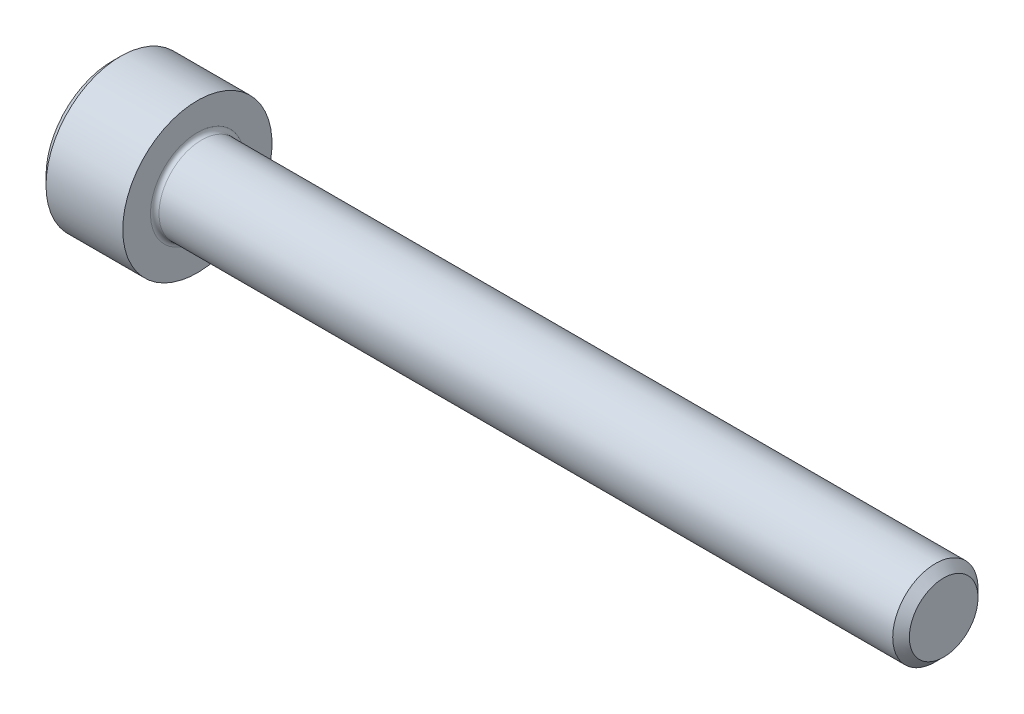
ISO-10303-21;
HEADER;
FILE_DESCRIPTION(('STEP AP214'),'2;1');
FILE_NAME('part.step','',(''),(''),'','','');
FILE_SCHEMA(('AUTOMOTIVE_DESIGN { 1 0 10303 214 1 1 1 1 }'));
ENDSEC;
DATA;
#1=APPLICATION_CONTEXT('core data for automotive mechanical design processes');
#2=APPLICATION_PROTOCOL_DEFINITION('international standard','automotive_design',2000,#1);
#3=PRODUCT_CONTEXT('',#1,'mechanical');
#4=PRODUCT('Part','Part','',(#3));
#5=PRODUCT_RELATED_PRODUCT_CATEGORY('part','',(#4));
#6=PRODUCT_DEFINITION_FORMATION('','',#4);
#7=PRODUCT_DEFINITION_CONTEXT('part definition',#1,'design');
#8=PRODUCT_DEFINITION('design','',#6,#7);
#9=PRODUCT_DEFINITION_SHAPE('','',#8);
#10=(LENGTH_UNIT() NAMED_UNIT(*) SI_UNIT(.MILLI.,.METRE.));
#11=(NAMED_UNIT(*) PLANE_ANGLE_UNIT() SI_UNIT($,.RADIAN.));
#12=(NAMED_UNIT(*) SI_UNIT($,.STERADIAN.) SOLID_ANGLE_UNIT());
#13=UNCERTAINTY_MEASURE_WITH_UNIT(LENGTH_MEASURE(1.E-05),#10,'distance_accuracy_value','');
#14=(GEOMETRIC_REPRESENTATION_CONTEXT(3) GLOBAL_UNCERTAINTY_ASSIGNED_CONTEXT((#13)) GLOBAL_UNIT_ASSIGNED_CONTEXT((#10,
#11,#12)) REPRESENTATION_CONTEXT('',''));
#15=CARTESIAN_POINT('',(0.,0.,0.));
#16=DIRECTION('',(0.,0.,1.));
#17=DIRECTION('',(1.,0.,0.));
#18=AXIS2_PLACEMENT_3D('',#15,#16,#17);
#19=CARTESIAN_POINT('',(0.,0.,0.));
#20=DIRECTION('',(-1.,0.,0.));
#21=DIRECTION('',(0.,0.,1.));
#22=AXIS2_PLACEMENT_3D('',#19,#20,#21);
#23=PLANE('',#22);
#24=DIRECTION('',(0.,-0.5,0.866025403784438));
#25=VECTOR('',#24,1.);
#26=CARTESIAN_POINT('',(0.,1.77304267668134,0.));
#27=LINE('',#26,#25);
#28=CARTESIAN_POINT('',(0.,1.77304267668134,0.));
#29=VERTEX_POINT('',#28);
#30=CARTESIAN_POINT('',(0.,0.886521338340669,1.5355));
#31=VERTEX_POINT('',#30);
#32=EDGE_CURVE('E387',#29,#31,#27,.T.);
#33=ORIENTED_EDGE('',*,*,#32,.T.);
#34=DIRECTION('',(0.,1.,0.));
#35=VECTOR('',#34,1.);
#36=CARTESIAN_POINT('',(0.,-0.886521338340673,1.5355));
#37=LINE('',#36,#35);
#38=CARTESIAN_POINT('',(0.,-0.886521338340673,1.5355));
#39=VERTEX_POINT('',#38);
#40=EDGE_CURVE('E131',#39,#31,#37,.T.);
#41=ORIENTED_EDGE('',*,*,#40,.F.);
#42=DIRECTION('',(0.,-0.500000000000001,-0.866025403784438));
#43=VECTOR('',#42,1.);
#44=CARTESIAN_POINT('',(0.,-0.886521338340673,1.5355));
#45=LINE('',#44,#43);
#46=CARTESIAN_POINT('',(0.,-1.77304267668135,0.));
#47=VERTEX_POINT('',#46);
#48=EDGE_CURVE('E390',#39,#47,#45,.T.);
#49=ORIENTED_EDGE('',*,*,#48,.T.);
#50=DIRECTION('',(0.,0.5,-0.866025403784439));
#51=VECTOR('',#50,1.);
#52=CARTESIAN_POINT('',(0.,-1.77304267668135,0.));
#53=LINE('',#52,#51);
#54=CARTESIAN_POINT('',(0.,-0.886521338340675,-1.5355));
#55=VERTEX_POINT('',#54);
#56=EDGE_CURVE('E393',#47,#55,#53,.T.);
#57=ORIENTED_EDGE('',*,*,#56,.T.);
#58=DIRECTION('',(0.,-1.,0.));
#59=VECTOR('',#58,1.);
#60=CARTESIAN_POINT('',(0.,0.886521338340666,-1.5355));
#61=LINE('',#60,#59);
#62=CARTESIAN_POINT('',(0.,0.886521338340666,-1.5355));
#63=VERTEX_POINT('',#62);
#64=EDGE_CURVE('E396',#63,#55,#61,.T.);
#65=ORIENTED_EDGE('',*,*,#64,.F.);
#66=DIRECTION('',(0.,-0.500000000000001,-0.866025403784438));
#67=VECTOR('',#66,1.);
#68=CARTESIAN_POINT('',(0.,1.77304267668134,0.));
#69=LINE('',#68,#67);
#70=EDGE_CURVE('E126',#29,#63,#69,.T.);
#71=ORIENTED_EDGE('',*,*,#70,.F.);
#72=EDGE_LOOP('',(#33,#41,#49,#57,#65,#71));
#73=FACE_BOUND('',#72,.T.);
#74=CARTESIAN_POINT('',(0.,0.,0.));
#75=DIRECTION('',(-1.,0.,0.));
#76=DIRECTION('',(0.,0.,1.));
#77=AXIS2_PLACEMENT_3D('',#74,#75,#76);
#78=CIRCLE('',#77,3.1);
#79=CARTESIAN_POINT('',(0.,0.,3.1));
#80=VERTEX_POINT('',#79);
#81=EDGE_CURVE('E142',#80,#80,#78,.T.);
#82=ORIENTED_EDGE('',*,*,#81,.T.);
#83=EDGE_LOOP('',(#82));
#84=FACE_BOUND('',#83,.T.);
#85=ADVANCED_FACE('F35',(#73,#84),#23,.T.);
#86=CARTESIAN_POINT('',(39.,1.61,0.));
#87=DIRECTION('',(1.,0.,0.));
#88=DIRECTION('',(0.,0.,-1.));
#89=AXIS2_PLACEMENT_3D('',#86,#87,#88);
#90=PLANE('',#89);
#91=CARTESIAN_POINT('',(39.,0.,0.));
#92=DIRECTION('',(-1.,0.,0.));
#93=DIRECTION('',(0.,0.,1.));
#94=AXIS2_PLACEMENT_3D('',#91,#92,#93);
#95=CIRCLE('',#94,1.61);
#96=CARTESIAN_POINT('',(39.,0.,1.61));
#97=VERTEX_POINT('',#96);
#98=EDGE_CURVE('E155',#97,#97,#95,.T.);
#99=ORIENTED_EDGE('',*,*,#98,.F.);
#100=EDGE_LOOP('',(#99));
#101=FACE_BOUND('',#100,.T.);
#102=ADVANCED_FACE('F176',(#101),#90,.T.);
#103=CARTESIAN_POINT('',(39.,0.,0.));
#104=DIRECTION('',(-1.,0.,0.));
#105=DIRECTION('',(0.,0.,1.));
#106=AXIS2_PLACEMENT_3D('',#103,#104,#105);
#107=CONICAL_SURFACE('',#106,1.61,0.785398163397247);
#108=CARTESIAN_POINT('',(38.6099999999999,0.,0.));
#109=DIRECTION('',(-1.,0.,0.));
#110=DIRECTION('',(0.,0.,1.));
#111=AXIS2_PLACEMENT_3D('',#108,#109,#110);
#112=CIRCLE('',#111,1.99999999999991);
#113=CARTESIAN_POINT('',(38.6099999999999,0.,1.99999999999991));
#114=VERTEX_POINT('',#113);
#115=EDGE_CURVE('E152',#114,#114,#112,.T.);
#116=ORIENTED_EDGE('',*,*,#115,.F.);
#117=EDGE_LOOP('',(#116));
#118=FACE_BOUND('',#117,.T.);
#119=ORIENTED_EDGE('',*,*,#98,.T.);
#120=EDGE_LOOP('',(#119));
#121=FACE_BOUND('',#120,.T.);
#122=ADVANCED_FACE('F182',(#118,#121),#107,.T.);
#123=CARTESIAN_POINT('',(-31.75,0.,0.));
#124=DIRECTION('',(-1.,0.,0.));
#125=DIRECTION('',(0.,0.,1.));
#126=AXIS2_PLACEMENT_3D('',#123,#124,#125);
#127=CYLINDRICAL_SURFACE('',#126,1.99999999999996);
#128=CARTESIAN_POINT('',(4.2,0.,0.));
#129=DIRECTION('',(1.,0.,0.));
#130=DIRECTION('',(0.,0.,-1.));
#131=AXIS2_PLACEMENT_3D('',#128,#129,#130);
#132=CIRCLE('',#131,1.99999999999996);
#133=CARTESIAN_POINT('',(4.2,0.,-1.99999999999996));
#134=VERTEX_POINT('',#133);
#135=EDGE_CURVE('E11',#134,#134,#132,.T.);
#136=ORIENTED_EDGE('',*,*,#135,.T.);
#137=EDGE_LOOP('',(#136));
#138=FACE_BOUND('',#137,.T.);
#139=ORIENTED_EDGE('',*,*,#115,.T.);
#140=EDGE_LOOP('',(#139));
#141=FACE_BOUND('',#140,.T.);
#142=ADVANCED_FACE('F193',(#138,#141),#127,.T.);
#143=CARTESIAN_POINT('',(4.,3.5,0.));
#144=DIRECTION('',(1.,0.,0.));
#145=DIRECTION('',(0.,0.,-1.));
#146=AXIS2_PLACEMENT_3D('',#143,#144,#145);
#147=PLANE('',#146);
#148=CARTESIAN_POINT('',(4.,0.,0.));
#149=DIRECTION('',(1.,0.,0.));
#150=DIRECTION('',(0.,0.,-1.));
#151=AXIS2_PLACEMENT_3D('',#148,#149,#150);
#152=CIRCLE('',#151,2.19999999999996);
#153=CARTESIAN_POINT('',(4.,0.,-2.19999999999996));
#154=VERTEX_POINT('',#153);
#155=EDGE_CURVE('E43',#154,#154,#152,.F.);
#156=ORIENTED_EDGE('',*,*,#155,.T.);
#157=EDGE_LOOP('',(#156));
#158=FACE_BOUND('',#157,.T.);
#159=CARTESIAN_POINT('',(4.,0.,0.));
#160=DIRECTION('',(-1.,0.,0.));
#161=DIRECTION('',(0.,0.,1.));
#162=AXIS2_PLACEMENT_3D('',#159,#160,#161);
#163=CIRCLE('',#162,3.5);
#164=CARTESIAN_POINT('',(4.,0.,3.5));
#165=VERTEX_POINT('',#164);
#166=EDGE_CURVE('E149',#165,#165,#163,.T.);
#167=ORIENTED_EDGE('',*,*,#166,.F.);
#168=EDGE_LOOP('',(#167));
#169=FACE_BOUND('',#168,.T.);
#170=ADVANCED_FACE('F160',(#158,#169),#147,.T.);
#171=CARTESIAN_POINT('',(-31.75,0.,0.));
#172=DIRECTION('',(-1.,0.,0.));
#173=DIRECTION('',(0.,0.,1.));
#174=AXIS2_PLACEMENT_3D('',#171,#172,#173);
#175=CYLINDRICAL_SURFACE('',#174,3.5);
#176=ORIENTED_EDGE('',*,*,#166,.T.);
#177=EDGE_LOOP('',(#176));
#178=FACE_BOUND('',#177,.T.);
#179=CARTESIAN_POINT('',(0.399999999999998,0.,0.));
#180=DIRECTION('',(-1.,0.,0.));
#181=DIRECTION('',(0.,0.,1.));
#182=AXIS2_PLACEMENT_3D('',#179,#180,#181);
#183=CIRCLE('',#182,3.5);
#184=CARTESIAN_POINT('',(0.399999999999998,0.,3.5));
#185=VERTEX_POINT('',#184);
#186=EDGE_CURVE('E146',#185,#185,#183,.T.);
#187=ORIENTED_EDGE('',*,*,#186,.F.);
#188=EDGE_LOOP('',(#187));
#189=FACE_BOUND('',#188,.T.);
#190=ADVANCED_FACE('F171',(#178,#189),#175,.T.);
#191=CARTESIAN_POINT('',(0.,0.,0.));
#192=DIRECTION('',(1.,0.,0.));
#193=DIRECTION('',(0.,0.,-1.));
#194=AXIS2_PLACEMENT_3D('',#191,#192,#193);
#195=CONICAL_SURFACE('',#194,3.1,0.78539816339745);
#196=ORIENTED_EDGE('',*,*,#186,.T.);
#197=EDGE_LOOP('',(#196));
#198=FACE_BOUND('',#197,.T.);
#199=ORIENTED_EDGE('',*,*,#81,.F.);
#200=EDGE_LOOP('',(#199));
#201=FACE_BOUND('',#200,.T.);
#202=ADVANCED_FACE('F164',(#198,#201),#195,.T.);
#203=CARTESIAN_POINT('',(4.2,0.,0.));
#204=DIRECTION('',(1.,0.,0.));
#205=DIRECTION('',(0.,0.,-1.));
#206=AXIS2_PLACEMENT_3D('',#203,#204,#205);
#207=TOROIDAL_SURFACE('',#206,2.19999999999996,0.2);
#208=ORIENTED_EDGE('',*,*,#135,.F.);
#209=EDGE_LOOP('',(#208));
#210=FACE_BOUND('',#209,.T.);
#211=ORIENTED_EDGE('',*,*,#155,.F.);
#212=EDGE_LOOP('',(#211));
#213=FACE_BOUND('',#212,.T.);
#214=ADVANCED_FACE('F37',(#210,#213),#207,.F.);
#215=CARTESIAN_POINT('',(2.,1.77304267668134,0.));
#216=DIRECTION('',(0.,-0.866025403784439,-0.5));
#217=DIRECTION('',(0.,0.5,-0.866025403784438));
#218=AXIS2_PLACEMENT_3D('',#215,#216,#217);
#219=PLANE('',#218);
#220=ORIENTED_EDGE('',*,*,#32,.F.);
#221=DIRECTION('',(-1.,0.,0.));
#222=VECTOR('',#221,1.);
#223=CARTESIAN_POINT('',(2.,1.77304267668134,0.));
#224=LINE('',#223,#222);
#225=CARTESIAN_POINT('',(2.,1.77304267668134,0.));
#226=VERTEX_POINT('',#225);
#227=EDGE_CURVE('E377',#226,#29,#224,.T.);
#228=ORIENTED_EDGE('',*,*,#227,.F.);
#229=DIRECTION('',(0.,-0.5,0.866025403784438));
#230=VECTOR('',#229,1.);
#231=CARTESIAN_POINT('',(2.,1.77304267668134,0.));
#232=LINE('',#231,#230);
#233=CARTESIAN_POINT('',(2.,1.329782007511,0.767749999999999));
#234=VERTEX_POINT('',#233);
#235=EDGE_CURVE('E118',#226,#234,#232,.T.);
#236=ORIENTED_EDGE('',*,*,#235,.T.);
#237=CARTESIAN_POINT('',(2.,0.886521338340669,1.5355));
#238=VERTEX_POINT('',#237);
#239=EDGE_CURVE('E109',#234,#238,#232,.T.);
#240=ORIENTED_EDGE('',*,*,#239,.T.);
#241=DIRECTION('',(-1.,0.,0.));
#242=VECTOR('',#241,1.);
#243=CARTESIAN_POINT('',(2.,0.886521338340669,1.5355));
#244=LINE('',#243,#242);
#245=EDGE_CURVE('E123',#238,#31,#244,.T.);
#246=ORIENTED_EDGE('',*,*,#245,.T.);
#247=EDGE_LOOP('',(#220,#228,#236,#240,#246));
#248=FACE_BOUND('',#247,.T.);
#249=ADVANCED_FACE('F122',(#248),#219,.T.);
#250=CARTESIAN_POINT('',(2.,-0.886521338340673,1.5355));
#251=DIRECTION('',(0.,0.,1.));
#252=DIRECTION('',(0.,-1.,0.));
#253=AXIS2_PLACEMENT_3D('',#250,#251,#252);
#254=PLANE('',#253);
#255=ORIENTED_EDGE('',*,*,#40,.T.);
#256=ORIENTED_EDGE('',*,*,#245,.F.);
#257=DIRECTION('',(0.,1.,0.));
#258=VECTOR('',#257,1.);
#259=CARTESIAN_POINT('',(2.,-0.886521338340673,1.5355));
#260=LINE('',#259,#258);
#261=CARTESIAN_POINT('',(2.,0.,1.5355));
#262=VERTEX_POINT('',#261);
#263=EDGE_CURVE('E106',#262,#238,#260,.T.);
#264=ORIENTED_EDGE('',*,*,#263,.F.);
#265=CARTESIAN_POINT('',(2.,-0.886521338340673,1.5355));
#266=VERTEX_POINT('',#265);
#267=EDGE_CURVE('E117',#266,#262,#260,.T.);
#268=ORIENTED_EDGE('',*,*,#267,.F.);
#269=DIRECTION('',(-1.,0.,0.));
#270=VECTOR('',#269,1.);
#271=CARTESIAN_POINT('',(2.,-0.886521338340673,1.5355));
#272=LINE('',#271,#270);
#273=EDGE_CURVE('E133',#266,#39,#272,.T.);
#274=ORIENTED_EDGE('',*,*,#273,.T.);
#275=EDGE_LOOP('',(#255,#256,#264,#268,#274));
#276=FACE_BOUND('',#275,.T.);
#277=ADVANCED_FACE('F128',(#276),#254,.F.);
#278=CARTESIAN_POINT('',(2.,-0.886521338340673,1.5355));
#279=DIRECTION('',(0.,0.866025403784438,-0.500000000000001));
#280=DIRECTION('',(0.,0.500000000000001,0.866025403784438));
#281=AXIS2_PLACEMENT_3D('',#278,#279,#280);
#282=PLANE('',#281);
#283=ORIENTED_EDGE('',*,*,#48,.F.);
#284=ORIENTED_EDGE('',*,*,#273,.F.);
#285=DIRECTION('',(0.,-0.500000000000001,-0.866025403784438));
#286=VECTOR('',#285,1.);
#287=CARTESIAN_POINT('',(2.,-0.886521338340673,1.5355));
#288=LINE('',#287,#286);
#289=CARTESIAN_POINT('',(2.,-1.32978200751101,0.767750000000003));
#290=VERTEX_POINT('',#289);
#291=EDGE_CURVE('E416',#266,#290,#288,.T.);
#292=ORIENTED_EDGE('',*,*,#291,.T.);
#293=CARTESIAN_POINT('',(2.,-1.77304267668135,0.));
#294=VERTEX_POINT('',#293);
#295=EDGE_CURVE('E405',#290,#294,#288,.T.);
#296=ORIENTED_EDGE('',*,*,#295,.T.);
#297=DIRECTION('',(-1.,0.,0.));
#298=VECTOR('',#297,1.);
#299=CARTESIAN_POINT('',(2.,-1.77304267668135,0.));
#300=LINE('',#299,#298);
#301=EDGE_CURVE('E138',#294,#47,#300,.T.);
#302=ORIENTED_EDGE('',*,*,#301,.T.);
#303=EDGE_LOOP('',(#283,#284,#292,#296,#302));
#304=FACE_BOUND('',#303,.T.);
#305=ADVANCED_FACE('F268',(#304),#282,.T.);
#306=CARTESIAN_POINT('',(2.,-1.77304267668135,0.));
#307=DIRECTION('',(0.,0.866025403784439,0.5));
#308=DIRECTION('',(0.,-0.5,0.866025403784439));
#309=AXIS2_PLACEMENT_3D('',#306,#307,#308);
#310=PLANE('',#309);
#311=ORIENTED_EDGE('',*,*,#56,.F.);
#312=ORIENTED_EDGE('',*,*,#301,.F.);
#313=DIRECTION('',(0.,0.5,-0.866025403784439));
#314=VECTOR('',#313,1.);
#315=CARTESIAN_POINT('',(2.,-1.77304267668135,0.));
#316=LINE('',#315,#314);
#317=CARTESIAN_POINT('',(2.,-1.32978200751101,-0.767750000000002));
#318=VERTEX_POINT('',#317);
#319=EDGE_CURVE('E383',#294,#318,#316,.T.);
#320=ORIENTED_EDGE('',*,*,#319,.T.);
#321=CARTESIAN_POINT('',(2.,-0.886521338340675,-1.5355));
#322=VERTEX_POINT('',#321);
#323=EDGE_CURVE('E415',#318,#322,#316,.T.);
#324=ORIENTED_EDGE('',*,*,#323,.T.);
#325=DIRECTION('',(-1.,0.,0.));
#326=VECTOR('',#325,1.);
#327=CARTESIAN_POINT('',(2.,-0.886521338340675,-1.5355));
#328=LINE('',#327,#326);
#329=EDGE_CURVE('E376',#322,#55,#328,.T.);
#330=ORIENTED_EDGE('',*,*,#329,.T.);
#331=EDGE_LOOP('',(#311,#312,#320,#324,#330));
#332=FACE_BOUND('',#331,.T.);
#333=ADVANCED_FACE('F276',(#332),#310,.T.);
#334=CARTESIAN_POINT('',(2.,0.886521338340666,-1.5355));
#335=DIRECTION('',(0.,0.,-1.));
#336=DIRECTION('',(0.,1.,0.));
#337=AXIS2_PLACEMENT_3D('',#334,#335,#336);
#338=PLANE('',#337);
#339=ORIENTED_EDGE('',*,*,#64,.T.);
#340=ORIENTED_EDGE('',*,*,#329,.F.);
#341=DIRECTION('',(0.,-1.,0.));
#342=VECTOR('',#341,1.);
#343=CARTESIAN_POINT('',(2.,0.886521338340666,-1.5355));
#344=LINE('',#343,#342);
#345=CARTESIAN_POINT('',(2.,0.,-1.5355));
#346=VERTEX_POINT('',#345);
#347=EDGE_CURVE('E380',#346,#322,#344,.T.);
#348=ORIENTED_EDGE('',*,*,#347,.F.);
#349=CARTESIAN_POINT('',(2.,0.886521338340666,-1.5355));
#350=VERTEX_POINT('',#349);
#351=EDGE_CURVE('E50',#350,#346,#344,.T.);
#352=ORIENTED_EDGE('',*,*,#351,.F.);
#353=DIRECTION('',(-1.,0.,0.));
#354=VECTOR('',#353,1.);
#355=CARTESIAN_POINT('',(2.,0.886521338340666,-1.5355));
#356=LINE('',#355,#354);
#357=EDGE_CURVE('E373',#350,#63,#356,.T.);
#358=ORIENTED_EDGE('',*,*,#357,.T.);
#359=EDGE_LOOP('',(#339,#340,#348,#352,#358));
#360=FACE_BOUND('',#359,.T.);
#361=ADVANCED_FACE('F285',(#360),#338,.F.);
#362=CARTESIAN_POINT('',(2.,1.77304267668134,0.));
#363=DIRECTION('',(0.,0.866025403784438,-0.500000000000001));
#364=DIRECTION('',(0.,0.500000000000001,0.866025403784438));
#365=AXIS2_PLACEMENT_3D('',#362,#363,#364);
#366=PLANE('',#365);
#367=ORIENTED_EDGE('',*,*,#70,.T.);
#368=ORIENTED_EDGE('',*,*,#357,.F.);
#369=DIRECTION('',(0.,-0.500000000000001,-0.866025403784438));
#370=VECTOR('',#369,1.);
#371=CARTESIAN_POINT('',(2.,1.77304267668134,0.));
#372=LINE('',#371,#370);
#373=CARTESIAN_POINT('',(2.,1.329782007511,-0.767750000000002));
#374=VERTEX_POINT('',#373);
#375=EDGE_CURVE('E363',#374,#350,#372,.T.);
#376=ORIENTED_EDGE('',*,*,#375,.F.);
#377=EDGE_CURVE('E369',#226,#374,#372,.T.);
#378=ORIENTED_EDGE('',*,*,#377,.F.);
#379=ORIENTED_EDGE('',*,*,#227,.T.);
#380=EDGE_LOOP('',(#367,#368,#376,#378,#379));
#381=FACE_BOUND('',#380,.T.);
#382=ADVANCED_FACE('F294',(#381),#366,.F.);
#383=CARTESIAN_POINT('',(2.,1.77304267668134,0.));
#384=DIRECTION('',(1.,0.,0.));
#385=DIRECTION('',(0.,0.,-1.));
#386=AXIS2_PLACEMENT_3D('',#383,#384,#385);
#387=PLANE('',#386);
#388=ORIENTED_EDGE('',*,*,#347,.T.);
#389=ORIENTED_EDGE('',*,*,#323,.F.);
#390=CARTESIAN_POINT('',(2.,0.,0.));
#391=DIRECTION('',(-1.,0.,0.));
#392=DIRECTION('',(0.,0.,1.));
#393=AXIS2_PLACEMENT_3D('',#390,#391,#392);
#394=CIRCLE('',#393,1.5355);
#395=EDGE_CURVE('E411',#346,#318,#394,.T.);
#396=ORIENTED_EDGE('',*,*,#395,.F.);
#397=EDGE_LOOP('',(#388,#389,#396));
#398=FACE_BOUND('',#397,.T.);
#399=ADVANCED_FACE('F303',(#398),#387,.F.);
#400=ORIENTED_EDGE('',*,*,#319,.F.);
#401=ORIENTED_EDGE('',*,*,#295,.F.);
#402=EDGE_CURVE('E136',#318,#290,#394,.T.);
#403=ORIENTED_EDGE('',*,*,#402,.F.);
#404=EDGE_LOOP('',(#400,#401,#403));
#405=FACE_BOUND('',#404,.T.);
#406=ADVANCED_FACE('F312',(#405),#387,.F.);
#407=ORIENTED_EDGE('',*,*,#291,.F.);
#408=ORIENTED_EDGE('',*,*,#267,.T.);
#409=EDGE_CURVE('E132',#290,#262,#394,.T.);
#410=ORIENTED_EDGE('',*,*,#409,.F.);
#411=EDGE_LOOP('',(#407,#408,#410));
#412=FACE_BOUND('',#411,.T.);
#413=ADVANCED_FACE('F321',(#412),#387,.F.);
#414=ORIENTED_EDGE('',*,*,#263,.T.);
#415=ORIENTED_EDGE('',*,*,#239,.F.);
#416=EDGE_CURVE('E112',#262,#234,#394,.T.);
#417=ORIENTED_EDGE('',*,*,#416,.F.);
#418=EDGE_LOOP('',(#414,#415,#417));
#419=FACE_BOUND('',#418,.T.);
#420=ADVANCED_FACE('F108',(#419),#387,.F.);
#421=ORIENTED_EDGE('',*,*,#235,.F.);
#422=ORIENTED_EDGE('',*,*,#377,.T.);
#423=EDGE_CURVE('E143',#234,#374,#394,.T.);
#424=ORIENTED_EDGE('',*,*,#423,.F.);
#425=EDGE_LOOP('',(#421,#422,#424));
#426=FACE_BOUND('',#425,.T.);
#427=ADVANCED_FACE('F336',(#426),#387,.F.);
#428=ORIENTED_EDGE('',*,*,#375,.T.);
#429=ORIENTED_EDGE('',*,*,#351,.T.);
#430=EDGE_CURVE('E366',#374,#346,#394,.T.);
#431=ORIENTED_EDGE('',*,*,#430,.F.);
#432=EDGE_LOOP('',(#428,#429,#431));
#433=FACE_BOUND('',#432,.T.);
#434=ADVANCED_FACE('F251',(#433),#387,.F.);
#435=CARTESIAN_POINT('',(2.,0.,0.));
#436=DIRECTION('',(-1.,0.,0.));
#437=DIRECTION('',(0.,0.,1.));
#438=AXIS2_PLACEMENT_3D('',#435,#436,#437);
#439=CONICAL_SURFACE('',#438,1.5355,1.04719755119659);
#440=CARTESIAN_POINT('',(2.88652133834068,0.,0.));
#441=VERTEX_POINT('',#440);
#442=VERTEX_LOOP('',#441);
#443=FACE_BOUND('',#442,.T.);
#444=ORIENTED_EDGE('',*,*,#416,.T.);
#445=ORIENTED_EDGE('',*,*,#423,.T.);
#446=ORIENTED_EDGE('',*,*,#430,.T.);
#447=ORIENTED_EDGE('',*,*,#395,.T.);
#448=ORIENTED_EDGE('',*,*,#402,.T.);
#449=ORIENTED_EDGE('',*,*,#409,.T.);
#450=EDGE_LOOP('',(#444,#445,#446,#447,#448,#449));
#451=FACE_BOUND('',#450,.T.);
#452=ADVANCED_FACE('F186',(#443,#451),#439,.F.);
#453=CLOSED_SHELL('',(#85,#102,#122,#142,#170,#190,#202,#214,#249,#277,#305,#333,#361,#382,#399,
#406,#413,#420,#427,#434,#452));
#454=MANIFOLD_SOLID_BREP('B2',#453);
#455=ADVANCED_BREP_SHAPE_REPRESENTATION('',(#18,#454),#14);
#456=SHAPE_DEFINITION_REPRESENTATION(#9,#455);
ENDSEC;
END-ISO-10303-21;
